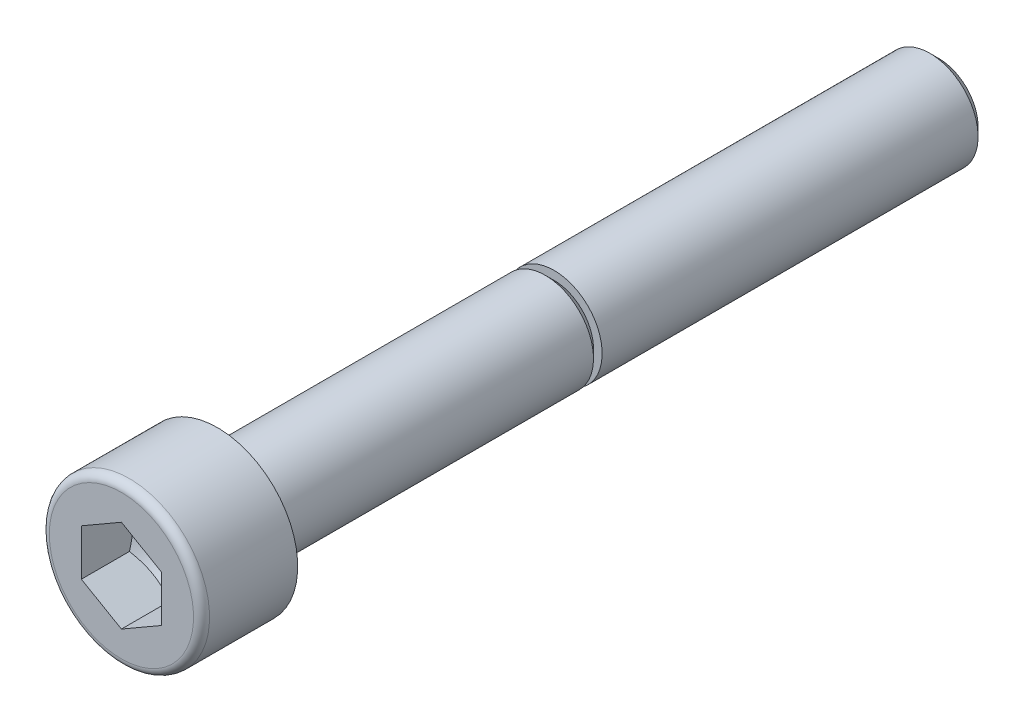
ISO-10303-21;
HEADER;
FILE_DESCRIPTION(('STEP AP214'),'2;1');
FILE_NAME('part.step','',(''),(''),'','','');
FILE_SCHEMA(('AUTOMOTIVE_DESIGN { 1 0 10303 214 1 1 1 1 }'));
ENDSEC;
DATA;
#1=APPLICATION_CONTEXT('core data for automotive mechanical design processes');
#2=APPLICATION_PROTOCOL_DEFINITION('international standard','automotive_design',2000,#1);
#3=PRODUCT_CONTEXT('',#1,'mechanical');
#4=PRODUCT('Part','Part','',(#3));
#5=PRODUCT_RELATED_PRODUCT_CATEGORY('part','',(#4));
#6=PRODUCT_DEFINITION_FORMATION('','',#4);
#7=PRODUCT_DEFINITION_CONTEXT('part definition',#1,'design');
#8=PRODUCT_DEFINITION('design','',#6,#7);
#9=PRODUCT_DEFINITION_SHAPE('','',#8);
#10=(LENGTH_UNIT() NAMED_UNIT(*) SI_UNIT(.MILLI.,.METRE.));
#11=(NAMED_UNIT(*) PLANE_ANGLE_UNIT() SI_UNIT($,.RADIAN.));
#12=(NAMED_UNIT(*) SI_UNIT($,.STERADIAN.) SOLID_ANGLE_UNIT());
#13=UNCERTAINTY_MEASURE_WITH_UNIT(LENGTH_MEASURE(1.E-05),#10,'distance_accuracy_value','');
#14=(GEOMETRIC_REPRESENTATION_CONTEXT(3) GLOBAL_UNCERTAINTY_ASSIGNED_CONTEXT((#13)) GLOBAL_UNIT_ASSIGNED_CONTEXT((#10,
#11,#12)) REPRESENTATION_CONTEXT('',''));
#15=CARTESIAN_POINT('',(0.,0.,0.));
#16=DIRECTION('',(0.,0.,1.));
#17=DIRECTION('',(1.,0.,0.));
#18=AXIS2_PLACEMENT_3D('',#15,#16,#17);
#19=CARTESIAN_POINT('',(-2.5,0.,0.));
#20=DIRECTION('',(0.,0.,-1.));
#21=DIRECTION('',(-1.,0.,0.));
#22=AXIS2_PLACEMENT_3D('',#19,#20,#21);
#23=PLANE('',#22);
#24=CARTESIAN_POINT('',(0.,0.,0.));
#25=DIRECTION('',(0.,0.,-1.));
#26=DIRECTION('',(-1.,0.,0.));
#27=AXIS2_PLACEMENT_3D('',#24,#25,#26);
#28=CIRCLE('',#27,5.);
#29=CARTESIAN_POINT('',(-5.,0.,0.));
#30=VERTEX_POINT('',#29);
#31=EDGE_CURVE('E11',#30,#30,#28,.T.);
#32=ORIENTED_EDGE('',*,*,#31,.T.);
#33=EDGE_LOOP('',(#32));
#34=FACE_BOUND('',#33,.T.);
#35=CARTESIAN_POINT('',(0.,0.,0.));
#36=DIRECTION('',(0.,0.,1.));
#37=DIRECTION('',(-1.,0.,0.));
#38=AXIS2_PLACEMENT_3D('',#35,#36,#37);
#39=CIRCLE('',#38,3.);
#40=CARTESIAN_POINT('',(3.,0.,0.));
#41=VERTEX_POINT('',#40);
#42=EDGE_CURVE('E90',#41,#41,#39,.T.);
#43=ORIENTED_EDGE('',*,*,#42,.T.);
#44=EDGE_LOOP('',(#43));
#45=FACE_BOUND('',#44,.T.);
#46=ADVANCED_FACE('F16',(#34,#45),#23,.T.);
#47=CARTESIAN_POINT('',(0.,0.,2.75));
#48=DIRECTION('',(0.,0.,1.));
#49=DIRECTION('',(-1.,0.,0.));
#50=AXIS2_PLACEMENT_3D('',#47,#48,#49);
#51=CYLINDRICAL_SURFACE('',#50,5.);
#52=CARTESIAN_POINT('',(0.,0.,5.5));
#53=DIRECTION('',(0.,0.,-1.));
#54=DIRECTION('',(-1.,0.,0.));
#55=AXIS2_PLACEMENT_3D('',#52,#53,#54);
#56=CIRCLE('',#55,5.);
#57=CARTESIAN_POINT('',(-5.,0.,5.5));
#58=VERTEX_POINT('',#57);
#59=EDGE_CURVE('E26',#58,#58,#56,.T.);
#60=ORIENTED_EDGE('',*,*,#59,.T.);
#61=EDGE_LOOP('',(#60));
#62=FACE_BOUND('',#61,.T.);
#63=ORIENTED_EDGE('',*,*,#31,.F.);
#64=EDGE_LOOP('',(#63));
#65=FACE_BOUND('',#64,.T.);
#66=ADVANCED_FACE('F181',(#62,#65),#51,.T.);
#67=CARTESIAN_POINT('',(0.,0.,5.5));
#68=DIRECTION('',(0.,0.,-1.));
#69=DIRECTION('',(0.,-1.,0.));
#70=AXIS2_PLACEMENT_3D('',#67,#68,#69);
#71=TOROIDAL_SURFACE('',#70,4.5,0.5);
#72=CARTESIAN_POINT('',(0.,0.,6.));
#73=DIRECTION('',(0.,0.,-1.));
#74=DIRECTION('',(-1.,0.,0.));
#75=AXIS2_PLACEMENT_3D('',#72,#73,#74);
#76=CIRCLE('',#75,4.5);
#77=CARTESIAN_POINT('',(-4.5,0.,6.));
#78=VERTEX_POINT('',#77);
#79=EDGE_CURVE('E110',#78,#78,#76,.T.);
#80=ORIENTED_EDGE('',*,*,#79,.T.);
#81=EDGE_LOOP('',(#80));
#82=FACE_BOUND('',#81,.T.);
#83=ORIENTED_EDGE('',*,*,#59,.F.);
#84=EDGE_LOOP('',(#83));
#85=FACE_BOUND('',#84,.T.);
#86=ADVANCED_FACE('F186',(#82,#85),#71,.T.);
#87=CARTESIAN_POINT('',(-2.25,0.,6.));
#88=DIRECTION('',(0.,0.,1.));
#89=DIRECTION('',(1.,0.,0.));
#90=AXIS2_PLACEMENT_3D('',#87,#88,#89);
#91=PLANE('',#90);
#92=ORIENTED_EDGE('',*,*,#79,.F.);
#93=EDGE_LOOP('',(#92));
#94=FACE_BOUND('',#93,.T.);
#95=DIRECTION('',(-0.866025403784439,-0.5,0.));
#96=VECTOR('',#95,1.);
#97=CARTESIAN_POINT('',(0.406249417187364,-2.65220178962874,6.));
#98=LINE('',#97,#96);
#99=CARTESIAN_POINT('',(2.49999883437473,-1.443375,6.));
#100=VERTEX_POINT('',#99);
#101=CARTESIAN_POINT('',(0.,-2.88675,6.));
#102=VERTEX_POINT('',#101);
#103=EDGE_CURVE('E137',#100,#102,#98,.T.);
#104=ORIENTED_EDGE('',*,*,#103,.T.);
#105=DIRECTION('',(-0.866025403784439,0.5,0.));
#106=VECTOR('',#105,1.);
#107=CARTESIAN_POINT('',(-2.09374941718736,-1.67792321037125,6.));
#108=LINE('',#107,#106);
#109=CARTESIAN_POINT('',(-2.49999883437473,-1.443375,6.));
#110=VERTEX_POINT('',#109);
#111=EDGE_CURVE('E96',#102,#110,#108,.T.);
#112=ORIENTED_EDGE('',*,*,#111,.T.);
#113=DIRECTION('',(0.,1.,0.));
#114=VECTOR('',#113,1.);
#115=CARTESIAN_POINT('',(-2.49999883437473,0.,6.));
#116=LINE('',#115,#114);
#117=CARTESIAN_POINT('',(-2.49999883437473,1.443375,6.));
#118=VERTEX_POINT('',#117);
#119=EDGE_CURVE('E106',#110,#118,#116,.T.);
#120=ORIENTED_EDGE('',*,*,#119,.T.);
#121=DIRECTION('',(0.866025403784439,0.5,0.));
#122=VECTOR('',#121,1.);
#123=CARTESIAN_POINT('',(-2.09374941718736,1.67792321037125,6.));
#124=LINE('',#123,#122);
#125=CARTESIAN_POINT('',(0.,2.88675,6.));
#126=VERTEX_POINT('',#125);
#127=EDGE_CURVE('E102',#118,#126,#124,.T.);
#128=ORIENTED_EDGE('',*,*,#127,.T.);
#129=DIRECTION('',(0.866025403784439,-0.5,0.));
#130=VECTOR('',#129,1.);
#131=CARTESIAN_POINT('',(0.406249417187364,2.65220178962874,6.));
#132=LINE('',#131,#130);
#133=CARTESIAN_POINT('',(2.49999883437473,1.443375,6.));
#134=VERTEX_POINT('',#133);
#135=EDGE_CURVE('E133',#126,#134,#132,.T.);
#136=ORIENTED_EDGE('',*,*,#135,.T.);
#137=DIRECTION('',(0.,-1.,0.));
#138=VECTOR('',#137,1.);
#139=CARTESIAN_POINT('',(2.49999883437473,0.,6.));
#140=LINE('',#139,#138);
#141=EDGE_CURVE('E136',#134,#100,#140,.T.);
#142=ORIENTED_EDGE('',*,*,#141,.T.);
#143=EDGE_LOOP('',(#104,#112,#120,#128,#136,#142));
#144=FACE_BOUND('',#143,.T.);
#145=ADVANCED_FACE('F203',(#94,#144),#91,.T.);
#146=CARTESIAN_POINT('',(-1.229375,0.,-45.));
#147=DIRECTION('',(0.,0.,-1.));
#148=DIRECTION('',(-1.,0.,0.));
#149=AXIS2_PLACEMENT_3D('',#146,#147,#148);
#150=PLANE('',#149);
#151=CARTESIAN_POINT('',(0.,0.,-45.));
#152=DIRECTION('',(0.,0.,-1.));
#153=DIRECTION('',(-1.,0.,0.));
#154=AXIS2_PLACEMENT_3D('',#151,#152,#153);
#155=CIRCLE('',#154,2.45875);
#156=CARTESIAN_POINT('',(-2.45875,0.,-45.));
#157=VERTEX_POINT('',#156);
#158=EDGE_CURVE('E112',#157,#157,#155,.T.);
#159=ORIENTED_EDGE('',*,*,#158,.T.);
#160=EDGE_LOOP('',(#159));
#161=FACE_BOUND('',#160,.T.);
#162=ADVANCED_FACE('F206',(#161),#150,.T.);
#163=CARTESIAN_POINT('',(0.,0.,-44.729375));
#164=DIRECTION('',(0.,0.,1.));
#165=DIRECTION('',(-1.,0.,0.));
#166=AXIS2_PLACEMENT_3D('',#163,#164,#165);
#167=CONICAL_SURFACE('',#166,2.729375,0.78539816339745);
#168=CARTESIAN_POINT('',(0.,0.,-44.45875));
#169=DIRECTION('',(0.,0.,-1.));
#170=DIRECTION('',(-1.,0.,0.));
#171=AXIS2_PLACEMENT_3D('',#168,#169,#170);
#172=CIRCLE('',#171,3.);
#173=CARTESIAN_POINT('',(-3.,0.,-44.45875));
#174=VERTEX_POINT('',#173);
#175=EDGE_CURVE('E100',#174,#174,#172,.T.);
#176=ORIENTED_EDGE('',*,*,#175,.T.);
#177=EDGE_LOOP('',(#176));
#178=FACE_BOUND('',#177,.T.);
#179=ORIENTED_EDGE('',*,*,#158,.F.);
#180=EDGE_LOOP('',(#179));
#181=FACE_BOUND('',#180,.T.);
#182=ADVANCED_FACE('F176',(#178,#181),#167,.T.);
#183=CARTESIAN_POINT('',(0.,0.,-32.729375));
#184=DIRECTION('',(0.,0.,1.));
#185=DIRECTION('',(-1.,0.,0.));
#186=AXIS2_PLACEMENT_3D('',#183,#184,#185);
#187=CYLINDRICAL_SURFACE('',#186,3.);
#188=CARTESIAN_POINT('',(0.,0.,-21.));
#189=DIRECTION('',(0.,0.,-1.));
#190=DIRECTION('',(-1.,0.,0.));
#191=AXIS2_PLACEMENT_3D('',#188,#189,#190);
#192=CIRCLE('',#191,3.);
#193=CARTESIAN_POINT('',(-3.,0.,-21.));
#194=VERTEX_POINT('',#193);
#195=EDGE_CURVE('E20',#194,#194,#192,.T.);
#196=ORIENTED_EDGE('',*,*,#195,.T.);
#197=EDGE_LOOP('',(#196));
#198=FACE_BOUND('',#197,.T.);
#199=ORIENTED_EDGE('',*,*,#175,.F.);
#200=EDGE_LOOP('',(#199));
#201=FACE_BOUND('',#200,.T.);
#202=ADVANCED_FACE('F162',(#198,#201),#187,.T.);
#203=CARTESIAN_POINT('',(-2.729375,0.,-21.));
#204=DIRECTION('',(0.,0.,1.));
#205=DIRECTION('',(1.,0.,0.));
#206=AXIS2_PLACEMENT_3D('',#203,#204,#205);
#207=PLANE('',#206);
#208=CARTESIAN_POINT('',(0.,0.,-21.));
#209=DIRECTION('',(0.,0.,-1.));
#210=DIRECTION('',(-1.,0.,0.));
#211=AXIS2_PLACEMENT_3D('',#208,#209,#210);
#212=CIRCLE('',#211,2.45875);
#213=CARTESIAN_POINT('',(-2.45875,0.,-21.));
#214=VERTEX_POINT('',#213);
#215=EDGE_CURVE('E92',#214,#214,#212,.T.);
#216=ORIENTED_EDGE('',*,*,#215,.T.);
#217=EDGE_LOOP('',(#216));
#218=FACE_BOUND('',#217,.T.);
#219=ORIENTED_EDGE('',*,*,#195,.F.);
#220=EDGE_LOOP('',(#219));
#221=FACE_BOUND('',#220,.T.);
#222=ADVANCED_FACE('F165',(#218,#221),#207,.T.);
#223=CARTESIAN_POINT('',(0.,0.,-20.729375));
#224=DIRECTION('',(0.,0.,1.));
#225=DIRECTION('',(-1.,0.,0.));
#226=AXIS2_PLACEMENT_3D('',#223,#224,#225);
#227=CONICAL_SURFACE('',#226,2.729375,0.78539816339745);
#228=CARTESIAN_POINT('',(0.,0.,-20.45875));
#229=DIRECTION('',(0.,0.,-1.));
#230=DIRECTION('',(-1.,0.,0.));
#231=AXIS2_PLACEMENT_3D('',#228,#229,#230);
#232=CIRCLE('',#231,3.);
#233=CARTESIAN_POINT('',(-3.,0.,-20.45875));
#234=VERTEX_POINT('',#233);
#235=EDGE_CURVE('E93',#234,#234,#232,.T.);
#236=ORIENTED_EDGE('',*,*,#235,.T.);
#237=EDGE_LOOP('',(#236));
#238=FACE_BOUND('',#237,.T.);
#239=ORIENTED_EDGE('',*,*,#215,.F.);
#240=EDGE_LOOP('',(#239));
#241=FACE_BOUND('',#240,.T.);
#242=ADVANCED_FACE('F18',(#238,#241),#227,.T.);
#243=CARTESIAN_POINT('',(0.,0.,-9.729375));
#244=DIRECTION('',(0.,0.,1.));
#245=DIRECTION('',(-1.,0.,0.));
#246=AXIS2_PLACEMENT_3D('',#243,#244,#245);
#247=CYLINDRICAL_SURFACE('',#246,3.);
#248=ORIENTED_EDGE('',*,*,#42,.F.);
#249=EDGE_LOOP('',(#248));
#250=FACE_BOUND('',#249,.T.);
#251=ORIENTED_EDGE('',*,*,#235,.F.);
#252=EDGE_LOOP('',(#251));
#253=FACE_BOUND('',#252,.T.);
#254=ADVANCED_FACE('F174',(#250,#253),#247,.T.);
#255=CARTESIAN_POINT('',(-1.24999941718736,-2.1650625,6.));
#256=DIRECTION('',(-0.5,-0.866025403784439,0.));
#257=DIRECTION('',(-0.866025403784439,0.5,0.));
#258=AXIS2_PLACEMENT_3D('',#255,#256,#257);
#259=PLANE('',#258);
#260=CARTESIAN_POINT('',(0.,-2.88675,3.));
#261=CARTESIAN_POINT('',(-1.24999941718736,-2.1650625,2.58333352760422));
#262=CARTESIAN_POINT('',(-2.49999883437473,-1.443375,3.));
#263=(BOUNDED_CURVE() B_SPLINE_CURVE(2,(#260,#261,#262),.UNSPECIFIED.,.F.,
.F.) B_SPLINE_CURVE_WITH_KNOTS((3,3),(0.,2.92108898323611),
.UNSPECIFIED.) CURVE() GEOMETRIC_REPRESENTATION_ITEM() RATIONAL_B_SPLINE_CURVE((1.,
1.15470053837925,1.)) REPRESENTATION_ITEM(''));
#264=CARTESIAN_POINT('',(0.,-2.88675,3.));
#265=VERTEX_POINT('',#264);
#266=CARTESIAN_POINT('',(-2.49999883437473,-1.443375,3.));
#267=VERTEX_POINT('',#266);
#268=EDGE_CURVE('E119',#265,#267,#263,.T.);
#269=ORIENTED_EDGE('',*,*,#268,.T.);
#270=DIRECTION('',(0.,0.,-1.));
#271=VECTOR('',#270,1.);
#272=CARTESIAN_POINT('',(-2.49999883437473,-1.443375,6.));
#273=LINE('',#272,#271);
#274=EDGE_CURVE('E108',#110,#267,#273,.T.);
#275=ORIENTED_EDGE('',*,*,#274,.F.);
#276=ORIENTED_EDGE('',*,*,#111,.F.);
#277=DIRECTION('',(0.,0.,-1.));
#278=VECTOR('',#277,1.);
#279=CARTESIAN_POINT('',(0.,-2.88675,6.));
#280=LINE('',#279,#278);
#281=EDGE_CURVE('E220',#102,#265,#280,.T.);
#282=ORIENTED_EDGE('',*,*,#281,.T.);
#283=EDGE_LOOP('',(#269,#275,#276,#282));
#284=FACE_BOUND('',#283,.T.);
#285=ADVANCED_FACE('F245',(#284),#259,.F.);
#286=CARTESIAN_POINT('',(-2.49999883437473,0.,6.));
#287=DIRECTION('',(-1.,0.,0.));
#288=DIRECTION('',(0.,1.,0.));
#289=AXIS2_PLACEMENT_3D('',#286,#287,#288);
#290=PLANE('',#289);
#291=CARTESIAN_POINT('',(-2.49999883437473,-1.443375,3.));
#292=CARTESIAN_POINT('',(-2.49999883437473,0.,2.58333352760421));
#293=CARTESIAN_POINT('',(-2.49999883437473,1.443375,3.));
#294=(BOUNDED_CURVE() B_SPLINE_CURVE(2,(#291,#292,#293),.UNSPECIFIED.,.F.,
.F.) B_SPLINE_CURVE_WITH_KNOTS((3,3),(0.,2.92108898323611),
.UNSPECIFIED.) CURVE() GEOMETRIC_REPRESENTATION_ITEM() RATIONAL_B_SPLINE_CURVE((1.,
1.15470053837925,1.)) REPRESENTATION_ITEM(''));
#295=CARTESIAN_POINT('',(-2.49999883437473,1.443375,3.));
#296=VERTEX_POINT('',#295);
#297=EDGE_CURVE('E128',#267,#296,#294,.T.);
#298=ORIENTED_EDGE('',*,*,#297,.T.);
#299=DIRECTION('',(0.,0.,-1.));
#300=VECTOR('',#299,1.);
#301=CARTESIAN_POINT('',(-2.49999883437473,1.443375,6.));
#302=LINE('',#301,#300);
#303=EDGE_CURVE('E103',#118,#296,#302,.T.);
#304=ORIENTED_EDGE('',*,*,#303,.F.);
#305=ORIENTED_EDGE('',*,*,#119,.F.);
#306=ORIENTED_EDGE('',*,*,#274,.T.);
#307=EDGE_LOOP('',(#298,#304,#305,#306));
#308=FACE_BOUND('',#307,.T.);
#309=ADVANCED_FACE('F241',(#308),#290,.F.);
#310=CARTESIAN_POINT('',(-1.24999941718736,2.1650625,6.));
#311=DIRECTION('',(-0.5,0.866025403784439,0.));
#312=DIRECTION('',(0.866025403784439,0.5,0.));
#313=AXIS2_PLACEMENT_3D('',#310,#311,#312);
#314=PLANE('',#313);
#315=CARTESIAN_POINT('',(-2.49999883437473,1.443375,3.));
#316=CARTESIAN_POINT('',(-1.24999941718736,2.1650625,2.58333352760421));
#317=CARTESIAN_POINT('',(0.,2.88675,3.));
#318=(BOUNDED_CURVE() B_SPLINE_CURVE(2,(#315,#316,#317),.UNSPECIFIED.,.F.,
.F.) B_SPLINE_CURVE_WITH_KNOTS((3,3),(0.,2.9210889832361),
.UNSPECIFIED.) CURVE() GEOMETRIC_REPRESENTATION_ITEM() RATIONAL_B_SPLINE_CURVE((1.,
1.15470053837926,1.)) REPRESENTATION_ITEM(''));
#319=CARTESIAN_POINT('',(0.,2.88675,3.));
#320=VERTEX_POINT('',#319);
#321=EDGE_CURVE('E120',#296,#320,#318,.T.);
#322=ORIENTED_EDGE('',*,*,#321,.T.);
#323=DIRECTION('',(0.,0.,-1.));
#324=VECTOR('',#323,1.);
#325=CARTESIAN_POINT('',(0.,2.88675,6.));
#326=LINE('',#325,#324);
#327=EDGE_CURVE('E104',#126,#320,#326,.T.);
#328=ORIENTED_EDGE('',*,*,#327,.F.);
#329=ORIENTED_EDGE('',*,*,#127,.F.);
#330=ORIENTED_EDGE('',*,*,#303,.T.);
#331=EDGE_LOOP('',(#322,#328,#329,#330));
#332=FACE_BOUND('',#331,.T.);
#333=ADVANCED_FACE('F200',(#332),#314,.F.);
#334=CARTESIAN_POINT('',(1.24999941718736,2.1650625,6.));
#335=DIRECTION('',(0.5,0.866025403784439,0.));
#336=DIRECTION('',(0.866025403784439,-0.5,0.));
#337=AXIS2_PLACEMENT_3D('',#334,#335,#336);
#338=PLANE('',#337);
#339=CARTESIAN_POINT('',(0.,2.88675,3.));
#340=CARTESIAN_POINT('',(1.24999941718736,2.1650625,2.58333352760421));
#341=CARTESIAN_POINT('',(2.49999883437473,1.443375,3.));
#342=(BOUNDED_CURVE() B_SPLINE_CURVE(2,(#339,#340,#341),.UNSPECIFIED.,.F.,
.F.) B_SPLINE_CURVE_WITH_KNOTS((3,3),(0.,2.9210889832361),
.UNSPECIFIED.) CURVE() GEOMETRIC_REPRESENTATION_ITEM() RATIONAL_B_SPLINE_CURVE((1.,
1.15470053837926,1.)) REPRESENTATION_ITEM(''));
#343=CARTESIAN_POINT('',(2.49999883437473,1.443375,3.));
#344=VERTEX_POINT('',#343);
#345=EDGE_CURVE('E225',#320,#344,#342,.T.);
#346=ORIENTED_EDGE('',*,*,#345,.T.);
#347=DIRECTION('',(0.,0.,-1.));
#348=VECTOR('',#347,1.);
#349=CARTESIAN_POINT('',(2.49999883437473,1.443375,6.));
#350=LINE('',#349,#348);
#351=EDGE_CURVE('E146',#134,#344,#350,.T.);
#352=ORIENTED_EDGE('',*,*,#351,.F.);
#353=ORIENTED_EDGE('',*,*,#135,.F.);
#354=ORIENTED_EDGE('',*,*,#327,.T.);
#355=EDGE_LOOP('',(#346,#352,#353,#354));
#356=FACE_BOUND('',#355,.T.);
#357=ADVANCED_FACE('F197',(#356),#338,.F.);
#358=CARTESIAN_POINT('',(2.49999883437473,0.,6.));
#359=DIRECTION('',(1.,0.,0.));
#360=DIRECTION('',(0.,-1.,0.));
#361=AXIS2_PLACEMENT_3D('',#358,#359,#360);
#362=PLANE('',#361);
#363=CARTESIAN_POINT('',(2.49999883437473,1.443375,3.));
#364=CARTESIAN_POINT('',(2.49999883437473,0.,2.58333352760421));
#365=CARTESIAN_POINT('',(2.49999883437473,-1.443375,3.));
#366=(BOUNDED_CURVE() B_SPLINE_CURVE(2,(#363,#364,#365),.UNSPECIFIED.,.F.,
.F.) B_SPLINE_CURVE_WITH_KNOTS((3,3),(0.,2.92108898323611),
.UNSPECIFIED.) CURVE() GEOMETRIC_REPRESENTATION_ITEM() RATIONAL_B_SPLINE_CURVE((1.,
1.15470053837925,1.)) REPRESENTATION_ITEM(''));
#367=CARTESIAN_POINT('',(2.49999883437473,-1.443375,3.));
#368=VERTEX_POINT('',#367);
#369=EDGE_CURVE('E118',#344,#368,#366,.T.);
#370=ORIENTED_EDGE('',*,*,#369,.T.);
#371=DIRECTION('',(0.,0.,-1.));
#372=VECTOR('',#371,1.);
#373=CARTESIAN_POINT('',(2.49999883437473,-1.443375,6.));
#374=LINE('',#373,#372);
#375=EDGE_CURVE('E134',#100,#368,#374,.T.);
#376=ORIENTED_EDGE('',*,*,#375,.F.);
#377=ORIENTED_EDGE('',*,*,#141,.F.);
#378=ORIENTED_EDGE('',*,*,#351,.T.);
#379=EDGE_LOOP('',(#370,#376,#377,#378));
#380=FACE_BOUND('',#379,.T.);
#381=ADVANCED_FACE('F195',(#380),#362,.F.);
#382=CARTESIAN_POINT('',(1.24999941718736,-2.1650625,6.));
#383=DIRECTION('',(0.5,-0.866025403784439,0.));
#384=DIRECTION('',(-0.866025403784439,-0.5,0.));
#385=AXIS2_PLACEMENT_3D('',#382,#383,#384);
#386=PLANE('',#385);
#387=CARTESIAN_POINT('',(2.49999883437473,-1.443375,3.));
#388=CARTESIAN_POINT('',(1.24999941718737,-2.1650625,2.58333352760422));
#389=CARTESIAN_POINT('',(0.,-2.88675,3.));
#390=(BOUNDED_CURVE() B_SPLINE_CURVE(2,(#387,#388,#389),.UNSPECIFIED.,.F.,
.F.) B_SPLINE_CURVE_WITH_KNOTS((3,3),(0.,2.92108898323611),
.UNSPECIFIED.) CURVE() GEOMETRIC_REPRESENTATION_ITEM() RATIONAL_B_SPLINE_CURVE((1.,
1.15470053837925,1.)) REPRESENTATION_ITEM(''));
#391=EDGE_CURVE('E113',#368,#265,#390,.T.);
#392=ORIENTED_EDGE('',*,*,#391,.T.);
#393=ORIENTED_EDGE('',*,*,#281,.F.);
#394=ORIENTED_EDGE('',*,*,#103,.F.);
#395=ORIENTED_EDGE('',*,*,#375,.T.);
#396=EDGE_LOOP('',(#392,#393,#394,#395));
#397=FACE_BOUND('',#396,.T.);
#398=ADVANCED_FACE('F191',(#397),#386,.F.);
#399=CARTESIAN_POINT('',(0.,0.,2.16666705520842));
#400=DIRECTION('',(0.,0.,1.));
#401=DIRECTION('',(-1.,0.,0.));
#402=AXIS2_PLACEMENT_3D('',#399,#400,#401);
#403=CONICAL_SURFACE('',#402,1.443375,1.0471975511966);
#404=CARTESIAN_POINT('',(0.,0.,1.33333411041685));
#405=VERTEX_POINT('',#404);
#406=VERTEX_LOOP('',#405);
#407=FACE_BOUND('',#406,.T.);
#408=ORIENTED_EDGE('',*,*,#321,.F.);
#409=ORIENTED_EDGE('',*,*,#297,.F.);
#410=ORIENTED_EDGE('',*,*,#268,.F.);
#411=ORIENTED_EDGE('',*,*,#391,.F.);
#412=ORIENTED_EDGE('',*,*,#369,.F.);
#413=ORIENTED_EDGE('',*,*,#345,.F.);
#414=EDGE_LOOP('',(#408,#409,#410,#411,#412,#413));
#415=FACE_BOUND('',#414,.T.);
#416=ADVANCED_FACE('F194',(#407,#415),#403,.F.);
#417=CLOSED_SHELL('',(#46,#66,#86,#145,#162,#182,#202,#222,#242,#254,#285,#309,#333,#357,#381,
#398,#416));
#418=MANIFOLD_SOLID_BREP('B1',#417);
#419=ADVANCED_BREP_SHAPE_REPRESENTATION('',(#18,#418),#14);
#420=SHAPE_DEFINITION_REPRESENTATION(#9,#419);
ENDSEC;
END-ISO-10303-21;
